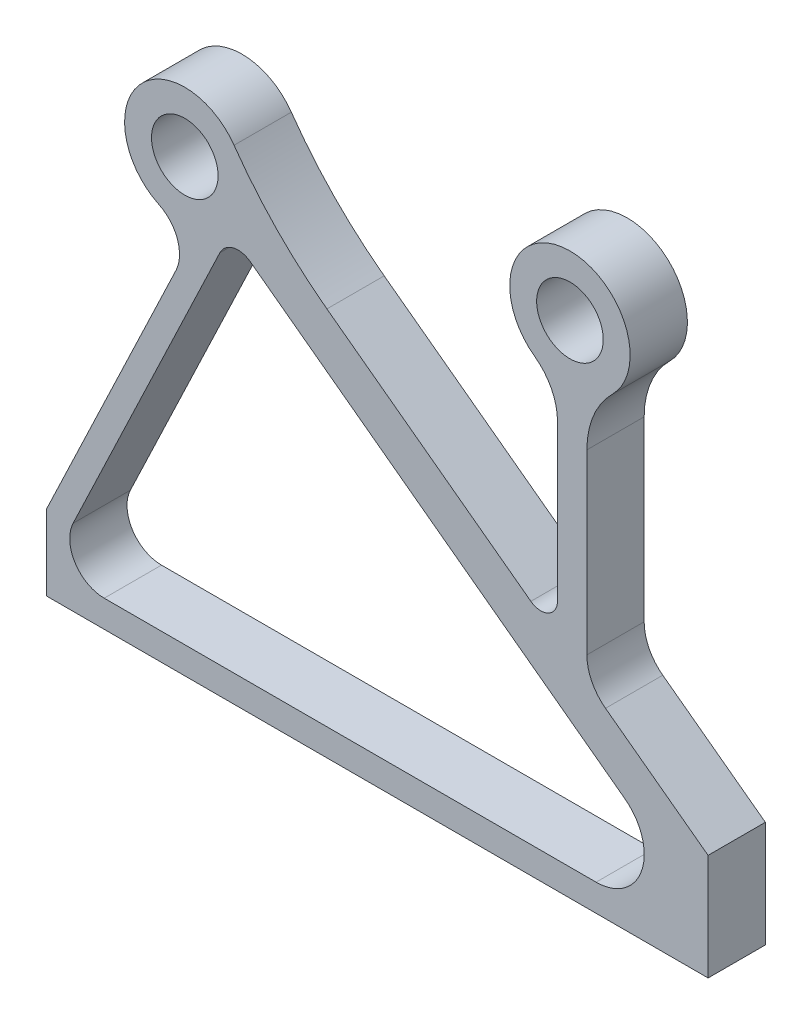
ISO-10303-21;
HEADER;
FILE_DESCRIPTION(('STEP AP214'),'2;1');
FILE_NAME('part.step','',(''),(''),'','','');
FILE_SCHEMA(('AUTOMOTIVE_DESIGN { 1 0 10303 214 1 1 1 1 }'));
ENDSEC;
DATA;
#1=APPLICATION_CONTEXT('core data for automotive mechanical design processes');
#2=APPLICATION_PROTOCOL_DEFINITION('international standard','automotive_design',2000,#1);
#3=PRODUCT_CONTEXT('',#1,'mechanical');
#4=PRODUCT('Part','Part','',(#3));
#5=PRODUCT_RELATED_PRODUCT_CATEGORY('part','',(#4));
#6=PRODUCT_DEFINITION_FORMATION('','',#4);
#7=PRODUCT_DEFINITION_CONTEXT('part definition',#1,'design');
#8=PRODUCT_DEFINITION('design','',#6,#7);
#9=PRODUCT_DEFINITION_SHAPE('','',#8);
#10=(LENGTH_UNIT() NAMED_UNIT(*) SI_UNIT(.MILLI.,.METRE.));
#11=(NAMED_UNIT(*) PLANE_ANGLE_UNIT() SI_UNIT($,.RADIAN.));
#12=(NAMED_UNIT(*) SI_UNIT($,.STERADIAN.) SOLID_ANGLE_UNIT());
#13=UNCERTAINTY_MEASURE_WITH_UNIT(LENGTH_MEASURE(1.E-05),#10,'distance_accuracy_value','');
#14=(GEOMETRIC_REPRESENTATION_CONTEXT(3) GLOBAL_UNCERTAINTY_ASSIGNED_CONTEXT((#13)) GLOBAL_UNIT_ASSIGNED_CONTEXT((#10,
#11,#12)) REPRESENTATION_CONTEXT('',''));
#15=CARTESIAN_POINT('',(0.,0.,0.));
#16=DIRECTION('',(0.,0.,1.));
#17=DIRECTION('',(1.,0.,0.));
#18=AXIS2_PLACEMENT_3D('',#15,#16,#17);
#19=CARTESIAN_POINT('',(368.937215512841,505.129816464179,40.));
#20=DIRECTION('',(0.,0.,1.));
#21=DIRECTION('',(1.,0.,0.));
#22=AXIS2_PLACEMENT_3D('',#19,#20,#21);
#23=PLANE('',#22);
#24=CARTESIAN_POINT('',(96.5,314.,40.));
#25=DIRECTION('',(0.,0.,1.));
#26=DIRECTION('',(1.,0.,0.));
#27=AXIS2_PLACEMENT_3D('',#24,#25,#26);
#28=CIRCLE('',#27,23.25);
#29=CARTESIAN_POINT('',(119.75,314.,40.));
#30=VERTEX_POINT('',#29);
#31=EDGE_CURVE('E251',#30,#30,#28,.T.);
#32=ORIENTED_EDGE('',*,*,#31,.F.);
#33=EDGE_LOOP('',(#32));
#34=FACE_BOUND('',#33,.T.);
#35=CARTESIAN_POINT('',(368.937215512841,505.129816464179,40.));
#36=DIRECTION('',(0.,0.,-1.));
#37=DIRECTION('',(1.,0.,0.));
#38=AXIS2_PLACEMENT_3D('',#35,#36,#37);
#39=CIRCLE('',#38,290.758684927088);
#40=CARTESIAN_POINT('',(195.757922755043,271.571375339825,40.));
#41=VERTEX_POINT('',#40);
#42=CARTESIAN_POINT('',(130.912486716467,338.142268000402,40.));
#43=VERTEX_POINT('',#42);
#44=EDGE_CURVE('E257',#41,#43,#39,.T.);
#45=ORIENTED_EDGE('',*,*,#44,.T.);
#46=CARTESIAN_POINT('',(96.5,314.,40.));
#47=DIRECTION('',(0.,0.,1.));
#48=DIRECTION('',(1.,0.,0.));
#49=AXIS2_PLACEMENT_3D('',#46,#47,#48);
#50=CIRCLE('',#49,42.0365120605205);
#51=CARTESIAN_POINT('',(78.3504812894364,276.083469082876,40.));
#52=VERTEX_POINT('',#51);
#53=EDGE_CURVE('E260',#43,#52,#50,.T.);
#54=ORIENTED_EDGE('',*,*,#53,.T.);
#55=CARTESIAN_POINT('',(67.3543979935997,253.111326465607,40.));
#56=DIRECTION('',(0.,0.,-1.));
#57=DIRECTION('',(1.,0.,0.));
#58=AXIS2_PLACEMENT_3D('',#55,#56,#57);
#59=CIRCLE('',#58,25.4682779998397);
#60=CARTESIAN_POINT('',(90.3406413482298,242.144749938776,40.));
#61=VERTEX_POINT('',#60);
#62=EDGE_CURVE('E263',#52,#61,#59,.T.);
#63=ORIENTED_EDGE('',*,*,#62,.T.);
#64=DIRECTION('',(-0.430597487859219,-0.902544072857016,0.));
#65=VECTOR('',#64,1.);
#66=CARTESIAN_POINT('',(90.3406413482298,242.144749938776,40.));
#67=LINE('',#66,#65);
#68=CARTESIAN_POINT('',(0.,52.7883029415657,40.));
#69=VERTEX_POINT('',#68);
#70=EDGE_CURVE('E265',#61,#69,#67,.T.);
#71=ORIENTED_EDGE('',*,*,#70,.T.);
#72=DIRECTION('',(0.,-1.,0.));
#73=VECTOR('',#72,1.);
#74=CARTESIAN_POINT('',(0.,52.7883029415657,40.));
#75=LINE('',#74,#73);
#76=CARTESIAN_POINT('',(0.,0.,40.));
#77=VERTEX_POINT('',#76);
#78=EDGE_CURVE('E267',#69,#77,#75,.T.);
#79=ORIENTED_EDGE('',*,*,#78,.T.);
#80=DIRECTION('',(1.,0.,0.));
#81=VECTOR('',#80,1.);
#82=CARTESIAN_POINT('',(462.,0.,40.));
#83=LINE('',#82,#81);
#84=CARTESIAN_POINT('',(462.,0.,40.));
#85=VERTEX_POINT('',#84);
#86=EDGE_CURVE('E269',#77,#85,#83,.T.);
#87=ORIENTED_EDGE('',*,*,#86,.T.);
#88=DIRECTION('',(-0.000294675893566808,0.999999956583058,0.));
#89=VECTOR('',#88,1.);
#90=CARTESIAN_POINT('',(461.978142717074,74.1739736920614,40.));
#91=LINE('',#90,#89);
#92=CARTESIAN_POINT('',(461.978142717074,74.1739736920614,40.));
#93=VERTEX_POINT('',#92);
#94=EDGE_CURVE('E271',#85,#93,#91,.T.);
#95=ORIENTED_EDGE('',*,*,#94,.T.);
#96=DIRECTION('',(-0.803272449739284,0.595611762383727,0.));
#97=VECTOR('',#96,1.);
#98=CARTESIAN_POINT('',(390.329817514419,127.299890384021,40.));
#99=LINE('',#98,#97);
#100=CARTESIAN_POINT('',(390.329817514419,127.299890384021,40.));
#101=VERTEX_POINT('',#100);
#102=EDGE_CURVE('E273',#93,#101,#99,.T.);
#103=ORIENTED_EDGE('',*,*,#102,.T.);
#104=CARTESIAN_POINT('',(409.472214887562,153.116305376008,40.));
#105=DIRECTION('',(0.,0.,-1.));
#106=DIRECTION('',(1.,0.,0.));
#107=AXIS2_PLACEMENT_3D('',#104,#105,#106);
#108=CIRCLE('',#107,32.1390519497667);
#109=CARTESIAN_POINT('',(377.333162937795,153.116305376008,40.));
#110=VERTEX_POINT('',#109);
#111=EDGE_CURVE('E275',#101,#110,#108,.T.);
#112=ORIENTED_EDGE('',*,*,#111,.T.);
#113=DIRECTION('',(0.,1.,0.));
#114=VECTOR('',#113,1.);
#115=CARTESIAN_POINT('',(377.333162937795,277.104406008865,40.));
#116=LINE('',#115,#114);
#117=CARTESIAN_POINT('',(377.333162937795,277.104406008865,40.));
#118=VERTEX_POINT('',#117);
#119=EDGE_CURVE('E277',#110,#118,#116,.T.);
#120=ORIENTED_EDGE('',*,*,#119,.T.);
#121=CARTESIAN_POINT('',(437.162247016224,277.104406008865,40.));
#122=DIRECTION('',(0.,0.,-1.));
#123=DIRECTION('',(-1.,0.,0.));
#124=AXIS2_PLACEMENT_3D('',#121,#122,#123);
#125=CIRCLE('',#124,59.8290840784292);
#126=CARTESIAN_POINT('',(395.072603755957,319.624768564789,40.));
#127=VERTEX_POINT('',#126);
#128=EDGE_CURVE('E281',#118,#127,#125,.T.);
#129=ORIENTED_EDGE('',*,*,#128,.T.);
#130=CARTESIAN_POINT('',(365.5,349.5,40.));
#131=DIRECTION('',(0.,0.,1.));
#132=DIRECTION('',(1.,0.,0.));
#133=AXIS2_PLACEMENT_3D('',#130,#131,#132);
#134=CIRCLE('',#133,42.0365120605205);
#135=CARTESIAN_POINT('',(340.80365373767,315.482962687715,40.));
#136=VERTEX_POINT('',#135);
#137=EDGE_CURVE('E283',#127,#136,#134,.T.);
#138=ORIENTED_EDGE('',*,*,#137,.T.);
#139=CARTESIAN_POINT('',(318.008834731175,284.085111344278,40.));
#140=DIRECTION('',(0.,0.,-1.));
#141=DIRECTION('',(-1.,0.,0.));
#142=AXIS2_PLACEMENT_3D('',#139,#140,#141);
#143=CIRCLE('',#142,38.7998562178193);
#144=CARTESIAN_POINT('',(356.808690948994,284.085111344278,40.));
#145=VERTEX_POINT('',#144);
#146=EDGE_CURVE('E285',#136,#145,#143,.T.);
#147=ORIENTED_EDGE('',*,*,#146,.T.);
#148=DIRECTION('',(0.,-1.,0.));
#149=VECTOR('',#148,1.);
#150=CARTESIAN_POINT('',(356.808690948994,284.085111344278,40.));
#151=LINE('',#150,#149);
#152=CARTESIAN_POINT('',(356.808690948994,175.310171823096,40.));
#153=VERTEX_POINT('',#152);
#154=EDGE_CURVE('E287',#145,#153,#151,.T.);
#155=ORIENTED_EDGE('',*,*,#154,.T.);
#156=CARTESIAN_POINT('',(345.151870943023,175.310171823096,40.));
#157=DIRECTION('',(0.,0.,-1.));
#158=DIRECTION('',(-1.,0.,0.));
#159=AXIS2_PLACEMENT_3D('',#156,#157,#158);
#160=CIRCLE('',#159,11.6568200059709);
#161=CARTESIAN_POINT('',(338.208931835477,165.94656946073,40.));
#162=VERTEX_POINT('',#161);
#163=EDGE_CURVE('E289',#153,#162,#160,.T.);
#164=ORIENTED_EDGE('',*,*,#163,.T.);
#165=DIRECTION('',(-0.803272449739284,0.595611762383727,0.));
#166=VECTOR('',#165,1.);
#167=CARTESIAN_POINT('',(338.208931835477,165.94656946073,40.));
#168=LINE('',#167,#166);
#169=EDGE_CURVE('E291',#162,#41,#168,.T.);
#170=ORIENTED_EDGE('',*,*,#169,.T.);
#171=EDGE_LOOP('',(#45,#54,#63,#71,#79,#87,#95,#103,#112,#120,#129,#138,#147,#155,#164,#170));
#172=FACE_BOUND('',#171,.T.);
#173=CARTESIAN_POINT('',(365.5,349.5,40.));
#174=DIRECTION('',(0.,0.,1.));
#175=DIRECTION('',(1.,0.,0.));
#176=AXIS2_PLACEMENT_3D('',#173,#174,#175);
#177=CIRCLE('',#176,23.25);
#178=CARTESIAN_POINT('',(388.75,349.5,40.));
#179=VERTEX_POINT('',#178);
#180=EDGE_CURVE('E245',#179,#179,#177,.T.);
#181=ORIENTED_EDGE('',*,*,#180,.F.);
#182=EDGE_LOOP('',(#181));
#183=FACE_BOUND('',#182,.T.);
#184=DIRECTION('',(-0.430597487859219,-0.902544072857016,0.));
#185=VECTOR('',#184,1.);
#186=CARTESIAN_POINT('',(18.4911150139431,53.2864328711373,40.));
#187=LINE('',#186,#185);
#188=CARTESIAN_POINT('',(120.985954342348,268.118410164344,40.));
#189=VERTEX_POINT('',#188);
#190=CARTESIAN_POINT('',(18.4911150139431,53.2864328711373,40.));
#191=VERTEX_POINT('',#190);
#192=EDGE_CURVE('E201',#189,#191,#187,.T.);
#193=ORIENTED_EDGE('',*,*,#192,.F.);
#194=CARTESIAN_POINT('',(133.772298014734,262.018134698786,40.));
#195=DIRECTION('',(0.,0.,1.));
#196=DIRECTION('',(-1.,0.,0.));
#197=AXIS2_PLACEMENT_3D('',#194,#195,#196);
#198=CIRCLE('',#197,14.1670019857439);
#199=CARTESIAN_POINT('',(142.210331035157,273.398097089336,40.));
#200=VERTEX_POINT('',#199);
#201=EDGE_CURVE('E193',#200,#189,#198,.T.);
#202=ORIENTED_EDGE('',*,*,#201,.F.);
#203=DIRECTION('',(-0.803272449739284,0.595611762383727,0.));
#204=VECTOR('',#203,1.);
#205=CARTESIAN_POINT('',(142.210331035157,273.398097089336,40.));
#206=LINE('',#205,#204);
#207=CARTESIAN_POINT('',(403.788200612837,79.4429129543513,40.));
#208=VERTEX_POINT('',#207);
#209=EDGE_CURVE('E223',#208,#200,#206,.T.);
#210=ORIENTED_EDGE('',*,*,#209,.F.);
#211=CARTESIAN_POINT('',(383.771110309799,52.4468423931808,40.));
#212=DIRECTION('',(0.,0.,1.));
#213=DIRECTION('',(-1.,0.,0.));
#214=AXIS2_PLACEMENT_3D('',#211,#212,#213);
#215=CIRCLE('',#214,33.6076141661931);
#216=CARTESIAN_POINT('',(383.771110309799,18.8392282269877,40.));
#217=VERTEX_POINT('',#216);
#218=EDGE_CURVE('E221',#217,#208,#215,.T.);
#219=ORIENTED_EDGE('',*,*,#218,.F.);
#220=DIRECTION('',(1.,0.,0.));
#221=VECTOR('',#220,1.);
#222=CARTESIAN_POINT('',(383.771110309799,18.8392282269877,40.));
#223=LINE('',#222,#221);
#224=CARTESIAN_POINT('',(40.2233776817561,18.8392282269876,40.));
#225=VERTEX_POINT('',#224);
#226=EDGE_CURVE('E216',#225,#217,#223,.T.);
#227=ORIENTED_EDGE('',*,*,#226,.F.);
#228=CARTESIAN_POINT('',(40.2233776817561,42.9181217917298,40.));
#229=DIRECTION('',(0.,0.,1.));
#230=DIRECTION('',(1.,0.,0.));
#231=AXIS2_PLACEMENT_3D('',#228,#229,#230);
#232=CIRCLE('',#231,24.0788935647422);
#233=EDGE_CURVE('E214',#191,#225,#232,.T.);
#234=ORIENTED_EDGE('',*,*,#233,.F.);
#235=EDGE_LOOP('',(#193,#202,#210,#219,#227,#234));
#236=FACE_BOUND('',#235,.T.);
#237=ADVANCED_FACE('F44',(#34,#172,#183,#236),#23,.T.);
#238=CARTESIAN_POINT('',(368.937215512841,505.129816464179,0.));
#239=DIRECTION('',(0.,0.,1.));
#240=DIRECTION('',(1.,0.,0.));
#241=AXIS2_PLACEMENT_3D('',#238,#239,#240);
#242=PLANE('',#241);
#243=CARTESIAN_POINT('',(365.5,349.5,0.));
#244=DIRECTION('',(0.,0.,1.));
#245=DIRECTION('',(1.,0.,0.));
#246=AXIS2_PLACEMENT_3D('',#243,#244,#245);
#247=CIRCLE('',#246,23.25);
#248=CARTESIAN_POINT('',(388.75,349.5,0.));
#249=VERTEX_POINT('',#248);
#250=EDGE_CURVE('E209',#249,#249,#247,.T.);
#251=ORIENTED_EDGE('',*,*,#250,.T.);
#252=EDGE_LOOP('',(#251));
#253=FACE_BOUND('',#252,.T.);
#254=CARTESIAN_POINT('',(96.5,314.,0.));
#255=DIRECTION('',(0.,0.,1.));
#256=DIRECTION('',(1.,0.,0.));
#257=AXIS2_PLACEMENT_3D('',#254,#255,#256);
#258=CIRCLE('',#257,23.25);
#259=CARTESIAN_POINT('',(119.75,314.,0.));
#260=VERTEX_POINT('',#259);
#261=EDGE_CURVE('E248',#260,#260,#258,.T.);
#262=ORIENTED_EDGE('',*,*,#261,.T.);
#263=EDGE_LOOP('',(#262));
#264=FACE_BOUND('',#263,.T.);
#265=CARTESIAN_POINT('',(368.937215512841,505.129816464179,0.));
#266=DIRECTION('',(0.,0.,-1.));
#267=DIRECTION('',(1.,0.,0.));
#268=AXIS2_PLACEMENT_3D('',#265,#266,#267);
#269=CIRCLE('',#268,290.758684927088);
#270=CARTESIAN_POINT('',(195.757922755043,271.571375339825,0.));
#271=VERTEX_POINT('',#270);
#272=CARTESIAN_POINT('',(130.912486716467,338.142268000402,0.));
#273=VERTEX_POINT('',#272);
#274=EDGE_CURVE('E254',#271,#273,#269,.T.);
#275=ORIENTED_EDGE('',*,*,#274,.F.);
#276=DIRECTION('',(-0.803272449739284,0.595611762383727,0.));
#277=VECTOR('',#276,1.);
#278=CARTESIAN_POINT('',(338.208931835477,165.94656946073,0.));
#279=LINE('',#278,#277);
#280=CARTESIAN_POINT('',(338.208931835477,165.94656946073,0.));
#281=VERTEX_POINT('',#280);
#282=EDGE_CURVE('E261',#281,#271,#279,.T.);
#283=ORIENTED_EDGE('',*,*,#282,.F.);
#284=CARTESIAN_POINT('',(345.151870943023,175.310171823096,0.));
#285=DIRECTION('',(0.,0.,-1.));
#286=DIRECTION('',(-1.,0.,0.));
#287=AXIS2_PLACEMENT_3D('',#284,#285,#286);
#288=CIRCLE('',#287,11.6568200059709);
#289=CARTESIAN_POINT('',(356.808690948994,175.310171823096,0.));
#290=VERTEX_POINT('',#289);
#291=EDGE_CURVE('E322',#290,#281,#288,.T.);
#292=ORIENTED_EDGE('',*,*,#291,.F.);
#293=DIRECTION('',(0.,-1.,0.));
#294=VECTOR('',#293,1.);
#295=CARTESIAN_POINT('',(356.808690948994,284.085111344278,0.));
#296=LINE('',#295,#294);
#297=CARTESIAN_POINT('',(356.808690948994,284.085111344278,0.));
#298=VERTEX_POINT('',#297);
#299=EDGE_CURVE('E320',#298,#290,#296,.T.);
#300=ORIENTED_EDGE('',*,*,#299,.F.);
#301=CARTESIAN_POINT('',(318.008834731175,284.085111344278,0.));
#302=DIRECTION('',(0.,0.,-1.));
#303=DIRECTION('',(-1.,0.,0.));
#304=AXIS2_PLACEMENT_3D('',#301,#302,#303);
#305=CIRCLE('',#304,38.7998562178193);
#306=CARTESIAN_POINT('',(340.80365373767,315.482962687715,0.));
#307=VERTEX_POINT('',#306);
#308=EDGE_CURVE('E318',#307,#298,#305,.T.);
#309=ORIENTED_EDGE('',*,*,#308,.F.);
#310=CARTESIAN_POINT('',(365.5,349.5,0.));
#311=DIRECTION('',(0.,0.,1.));
#312=DIRECTION('',(1.,0.,0.));
#313=AXIS2_PLACEMENT_3D('',#310,#311,#312);
#314=CIRCLE('',#313,42.0365120605205);
#315=CARTESIAN_POINT('',(395.072603755957,319.624768564789,0.));
#316=VERTEX_POINT('',#315);
#317=EDGE_CURVE('E316',#316,#307,#314,.T.);
#318=ORIENTED_EDGE('',*,*,#317,.F.);
#319=CARTESIAN_POINT('',(437.162247016224,277.104406008865,0.));
#320=DIRECTION('',(0.,0.,-1.));
#321=DIRECTION('',(-1.,0.,0.));
#322=AXIS2_PLACEMENT_3D('',#319,#320,#321);
#323=CIRCLE('',#322,59.8290840784292);
#324=CARTESIAN_POINT('',(377.333162937795,277.104406008865,0.));
#325=VERTEX_POINT('',#324);
#326=EDGE_CURVE('E314',#325,#316,#323,.T.);
#327=ORIENTED_EDGE('',*,*,#326,.F.);
#328=DIRECTION('',(0.,1.,0.));
#329=VECTOR('',#328,1.);
#330=CARTESIAN_POINT('',(377.333162937795,277.104406008865,0.));
#331=LINE('',#330,#329);
#332=CARTESIAN_POINT('',(377.333162937795,153.116305376008,0.));
#333=VERTEX_POINT('',#332);
#334=EDGE_CURVE('E312',#333,#325,#331,.T.);
#335=ORIENTED_EDGE('',*,*,#334,.F.);
#336=CARTESIAN_POINT('',(409.472214887562,153.116305376008,0.));
#337=DIRECTION('',(0.,0.,-1.));
#338=DIRECTION('',(1.,0.,0.));
#339=AXIS2_PLACEMENT_3D('',#336,#337,#338);
#340=CIRCLE('',#339,32.1390519497667);
#341=CARTESIAN_POINT('',(390.329817514419,127.299890384021,0.));
#342=VERTEX_POINT('',#341);
#343=EDGE_CURVE('E310',#342,#333,#340,.T.);
#344=ORIENTED_EDGE('',*,*,#343,.F.);
#345=DIRECTION('',(-0.803272449739284,0.595611762383727,0.));
#346=VECTOR('',#345,1.);
#347=CARTESIAN_POINT('',(390.329817514419,127.299890384021,0.));
#348=LINE('',#347,#346);
#349=CARTESIAN_POINT('',(461.978142717074,74.1739736920614,0.));
#350=VERTEX_POINT('',#349);
#351=EDGE_CURVE('E308',#350,#342,#348,.T.);
#352=ORIENTED_EDGE('',*,*,#351,.F.);
#353=DIRECTION('',(-0.000294675893566808,0.999999956583058,0.));
#354=VECTOR('',#353,1.);
#355=CARTESIAN_POINT('',(461.978142717074,74.1739736920614,0.));
#356=LINE('',#355,#354);
#357=CARTESIAN_POINT('',(462.,0.,0.));
#358=VERTEX_POINT('',#357);
#359=EDGE_CURVE('E306',#358,#350,#356,.T.);
#360=ORIENTED_EDGE('',*,*,#359,.F.);
#361=DIRECTION('',(1.,0.,0.));
#362=VECTOR('',#361,1.);
#363=CARTESIAN_POINT('',(462.,0.,0.));
#364=LINE('',#363,#362);
#365=CARTESIAN_POINT('',(0.,0.,0.));
#366=VERTEX_POINT('',#365);
#367=EDGE_CURVE('E304',#366,#358,#364,.T.);
#368=ORIENTED_EDGE('',*,*,#367,.F.);
#369=DIRECTION('',(0.,-1.,0.));
#370=VECTOR('',#369,1.);
#371=CARTESIAN_POINT('',(0.,52.7883029415657,0.));
#372=LINE('',#371,#370);
#373=CARTESIAN_POINT('',(0.,52.7883029415657,0.));
#374=VERTEX_POINT('',#373);
#375=EDGE_CURVE('E302',#374,#366,#372,.T.);
#376=ORIENTED_EDGE('',*,*,#375,.F.);
#377=DIRECTION('',(-0.430597487859219,-0.902544072857016,0.));
#378=VECTOR('',#377,1.);
#379=CARTESIAN_POINT('',(90.3406413482298,242.144749938776,0.));
#380=LINE('',#379,#378);
#381=CARTESIAN_POINT('',(90.3406413482298,242.144749938776,0.));
#382=VERTEX_POINT('',#381);
#383=EDGE_CURVE('E300',#382,#374,#380,.T.);
#384=ORIENTED_EDGE('',*,*,#383,.F.);
#385=CARTESIAN_POINT('',(67.3543979935997,253.111326465607,0.));
#386=DIRECTION('',(0.,0.,-1.));
#387=DIRECTION('',(1.,0.,0.));
#388=AXIS2_PLACEMENT_3D('',#385,#386,#387);
#389=CIRCLE('',#388,25.4682779998397);
#390=CARTESIAN_POINT('',(78.3504812894364,276.083469082876,0.));
#391=VERTEX_POINT('',#390);
#392=EDGE_CURVE('E298',#391,#382,#389,.T.);
#393=ORIENTED_EDGE('',*,*,#392,.F.);
#394=CARTESIAN_POINT('',(96.5,314.,0.));
#395=DIRECTION('',(0.,0.,1.));
#396=DIRECTION('',(1.,0.,0.));
#397=AXIS2_PLACEMENT_3D('',#394,#395,#396);
#398=CIRCLE('',#397,42.0365120605205);
#399=EDGE_CURVE('E296',#273,#391,#398,.T.);
#400=ORIENTED_EDGE('',*,*,#399,.F.);
#401=EDGE_LOOP('',(#275,#283,#292,#300,#309,#318,#327,#335,#344,#352,#360,#368,#376,#384,#393,#400));
#402=FACE_BOUND('',#401,.T.);
#403=CARTESIAN_POINT('',(133.772298014734,262.018134698786,0.));
#404=DIRECTION('',(0.,0.,1.));
#405=DIRECTION('',(-1.,0.,0.));
#406=AXIS2_PLACEMENT_3D('',#403,#404,#405);
#407=CIRCLE('',#406,14.1670019857439);
#408=CARTESIAN_POINT('',(142.210331035157,273.398097089336,0.));
#409=VERTEX_POINT('',#408);
#410=CARTESIAN_POINT('',(120.985954342348,268.118410164344,0.));
#411=VERTEX_POINT('',#410);
#412=EDGE_CURVE('E67',#409,#411,#407,.T.);
#413=ORIENTED_EDGE('',*,*,#412,.T.);
#414=DIRECTION('',(-0.430597487859219,-0.902544072857016,0.));
#415=VECTOR('',#414,1.);
#416=CARTESIAN_POINT('',(18.4911150139431,53.2864328711373,0.));
#417=LINE('',#416,#415);
#418=CARTESIAN_POINT('',(18.4911150139431,53.2864328711373,0.));
#419=VERTEX_POINT('',#418);
#420=EDGE_CURVE('E208',#411,#419,#417,.T.);
#421=ORIENTED_EDGE('',*,*,#420,.T.);
#422=CARTESIAN_POINT('',(40.2233776817561,42.9181217917298,0.));
#423=DIRECTION('',(0.,0.,1.));
#424=DIRECTION('',(1.,0.,0.));
#425=AXIS2_PLACEMENT_3D('',#422,#423,#424);
#426=CIRCLE('',#425,24.0788935647422);
#427=CARTESIAN_POINT('',(40.2233776817561,18.8392282269876,0.));
#428=VERTEX_POINT('',#427);
#429=EDGE_CURVE('E227',#419,#428,#426,.T.);
#430=ORIENTED_EDGE('',*,*,#429,.T.);
#431=DIRECTION('',(1.,0.,0.));
#432=VECTOR('',#431,1.);
#433=CARTESIAN_POINT('',(383.771110309799,18.8392282269877,0.));
#434=LINE('',#433,#432);
#435=CARTESIAN_POINT('',(383.771110309799,18.8392282269877,0.));
#436=VERTEX_POINT('',#435);
#437=EDGE_CURVE('E230',#428,#436,#434,.T.);
#438=ORIENTED_EDGE('',*,*,#437,.T.);
#439=CARTESIAN_POINT('',(383.771110309799,52.4468423931808,0.));
#440=DIRECTION('',(0.,0.,1.));
#441=DIRECTION('',(-1.,0.,0.));
#442=AXIS2_PLACEMENT_3D('',#439,#440,#441);
#443=CIRCLE('',#442,33.6076141661931);
#444=CARTESIAN_POINT('',(403.788200612837,79.4429129543514,0.));
#445=VERTEX_POINT('',#444);
#446=EDGE_CURVE('E233',#436,#445,#443,.T.);
#447=ORIENTED_EDGE('',*,*,#446,.T.);
#448=DIRECTION('',(-0.803272449739284,0.595611762383727,0.));
#449=VECTOR('',#448,1.);
#450=CARTESIAN_POINT('',(142.210331035157,273.398097089336,0.));
#451=LINE('',#450,#449);
#452=EDGE_CURVE('E202',#445,#409,#451,.T.);
#453=ORIENTED_EDGE('',*,*,#452,.T.);
#454=EDGE_LOOP('',(#413,#421,#430,#438,#447,#453));
#455=FACE_BOUND('',#454,.T.);
#456=ADVANCED_FACE('F376',(#253,#264,#402,#455),#242,.F.);
#457=CARTESIAN_POINT('',(368.937215512841,505.129816464179,40.));
#458=DIRECTION('',(0.,0.,-1.));
#459=DIRECTION('',(-1.,0.,0.));
#460=AXIS2_PLACEMENT_3D('',#457,#458,#459);
#461=CYLINDRICAL_SURFACE('',#460,290.758684927088);
#462=ORIENTED_EDGE('',*,*,#274,.T.);
#463=DIRECTION('',(0.,0.,-1.));
#464=VECTOR('',#463,1.);
#465=CARTESIAN_POINT('',(130.912486716467,338.142268000402,40.));
#466=LINE('',#465,#464);
#467=EDGE_CURVE('E12',#43,#273,#466,.T.);
#468=ORIENTED_EDGE('',*,*,#467,.F.);
#469=ORIENTED_EDGE('',*,*,#44,.F.);
#470=DIRECTION('',(0.,0.,-1.));
#471=VECTOR('',#470,1.);
#472=CARTESIAN_POINT('',(195.757922755043,271.571375339825,40.));
#473=LINE('',#472,#471);
#474=EDGE_CURVE('E293',#41,#271,#473,.T.);
#475=ORIENTED_EDGE('',*,*,#474,.T.);
#476=EDGE_LOOP('',(#462,#468,#469,#475));
#477=FACE_BOUND('',#476,.T.);
#478=ADVANCED_FACE('F46',(#477),#461,.F.);
#479=CARTESIAN_POINT('',(96.5,314.,40.));
#480=DIRECTION('',(0.,0.,-1.));
#481=DIRECTION('',(-1.,0.,0.));
#482=AXIS2_PLACEMENT_3D('',#479,#480,#481);
#483=CYLINDRICAL_SURFACE('',#482,42.0365120605205);
#484=ORIENTED_EDGE('',*,*,#399,.T.);
#485=DIRECTION('',(0.,0.,-1.));
#486=VECTOR('',#485,1.);
#487=CARTESIAN_POINT('',(78.3504812894364,276.083469082876,40.));
#488=LINE('',#487,#486);
#489=EDGE_CURVE('E52',#52,#391,#488,.T.);
#490=ORIENTED_EDGE('',*,*,#489,.F.);
#491=ORIENTED_EDGE('',*,*,#53,.F.);
#492=ORIENTED_EDGE('',*,*,#467,.T.);
#493=EDGE_LOOP('',(#484,#490,#491,#492));
#494=FACE_BOUND('',#493,.T.);
#495=ADVANCED_FACE('F394',(#494),#483,.T.);
#496=CARTESIAN_POINT('',(67.3543979935997,253.111326465607,40.));
#497=DIRECTION('',(0.,0.,-1.));
#498=DIRECTION('',(-1.,0.,0.));
#499=AXIS2_PLACEMENT_3D('',#496,#497,#498);
#500=CYLINDRICAL_SURFACE('',#499,25.4682779998397);
#501=ORIENTED_EDGE('',*,*,#392,.T.);
#502=DIRECTION('',(0.,0.,-1.));
#503=VECTOR('',#502,1.);
#504=CARTESIAN_POINT('',(90.3406413482298,242.144749938776,40.));
#505=LINE('',#504,#503);
#506=EDGE_CURVE('E363',#61,#382,#505,.T.);
#507=ORIENTED_EDGE('',*,*,#506,.F.);
#508=ORIENTED_EDGE('',*,*,#62,.F.);
#509=ORIENTED_EDGE('',*,*,#489,.T.);
#510=EDGE_LOOP('',(#501,#507,#508,#509));
#511=FACE_BOUND('',#510,.T.);
#512=ADVANCED_FACE('F370',(#511),#500,.F.);
#513=CARTESIAN_POINT('',(90.3406413482298,242.144749938776,40.));
#514=DIRECTION('',(0.902544072857016,-0.430597487859219,0.));
#515=DIRECTION('',(0.430597487859219,0.902544072857016,0.));
#516=AXIS2_PLACEMENT_3D('',#513,#514,#515);
#517=PLANE('',#516);
#518=ORIENTED_EDGE('',*,*,#383,.T.);
#519=DIRECTION('',(0.,0.,-1.));
#520=VECTOR('',#519,1.);
#521=CARTESIAN_POINT('',(0.,52.7883029415657,40.));
#522=LINE('',#521,#520);
#523=EDGE_CURVE('E360',#69,#374,#522,.T.);
#524=ORIENTED_EDGE('',*,*,#523,.F.);
#525=ORIENTED_EDGE('',*,*,#70,.F.);
#526=ORIENTED_EDGE('',*,*,#506,.T.);
#527=EDGE_LOOP('',(#518,#524,#525,#526));
#528=FACE_BOUND('',#527,.T.);
#529=ADVANCED_FACE('F382',(#528),#517,.F.);
#530=CARTESIAN_POINT('',(0.,52.7883029415657,40.));
#531=DIRECTION('',(1.,0.,0.));
#532=DIRECTION('',(0.,0.,-1.));
#533=AXIS2_PLACEMENT_3D('',#530,#531,#532);
#534=PLANE('',#533);
#535=ORIENTED_EDGE('',*,*,#375,.T.);
#536=DIRECTION('',(0.,0.,-1.));
#537=VECTOR('',#536,1.);
#538=CARTESIAN_POINT('',(0.,0.,40.));
#539=LINE('',#538,#537);
#540=EDGE_CURVE('E357',#77,#366,#539,.T.);
#541=ORIENTED_EDGE('',*,*,#540,.F.);
#542=ORIENTED_EDGE('',*,*,#78,.F.);
#543=ORIENTED_EDGE('',*,*,#523,.T.);
#544=EDGE_LOOP('',(#535,#541,#542,#543));
#545=FACE_BOUND('',#544,.T.);
#546=ADVANCED_FACE('F386',(#545),#534,.F.);
#547=CARTESIAN_POINT('',(462.,0.,40.));
#548=DIRECTION('',(0.,1.,0.));
#549=DIRECTION('',(0.,0.,1.));
#550=AXIS2_PLACEMENT_3D('',#547,#548,#549);
#551=PLANE('',#550);
#552=ORIENTED_EDGE('',*,*,#367,.T.);
#553=DIRECTION('',(0.,0.,-1.));
#554=VECTOR('',#553,1.);
#555=CARTESIAN_POINT('',(462.,0.,40.));
#556=LINE('',#555,#554);
#557=EDGE_CURVE('E354',#85,#358,#556,.T.);
#558=ORIENTED_EDGE('',*,*,#557,.F.);
#559=ORIENTED_EDGE('',*,*,#86,.F.);
#560=ORIENTED_EDGE('',*,*,#540,.T.);
#561=EDGE_LOOP('',(#552,#558,#559,#560));
#562=FACE_BOUND('',#561,.T.);
#563=ADVANCED_FACE('F447',(#562),#551,.F.);
#564=CARTESIAN_POINT('',(461.978142717074,74.1739736920614,40.));
#565=DIRECTION('',(-0.999999956583058,-0.000294675893566808,0.));
#566=DIRECTION('',(0.000294675893566808,-0.999999956583058,0.));
#567=AXIS2_PLACEMENT_3D('',#564,#565,#566);
#568=PLANE('',#567);
#569=ORIENTED_EDGE('',*,*,#359,.T.);
#570=DIRECTION('',(0.,0.,-1.));
#571=VECTOR('',#570,1.);
#572=CARTESIAN_POINT('',(461.978142717074,74.1739736920614,40.));
#573=LINE('',#572,#571);
#574=EDGE_CURVE('E351',#93,#350,#573,.T.);
#575=ORIENTED_EDGE('',*,*,#574,.F.);
#576=ORIENTED_EDGE('',*,*,#94,.F.);
#577=ORIENTED_EDGE('',*,*,#557,.T.);
#578=EDGE_LOOP('',(#569,#575,#576,#577));
#579=FACE_BOUND('',#578,.T.);
#580=ADVANCED_FACE('F444',(#579),#568,.F.);
#581=CARTESIAN_POINT('',(390.329817514419,127.299890384021,40.));
#582=DIRECTION('',(-0.595611762383727,-0.803272449739284,0.));
#583=DIRECTION('',(0.803272449739284,-0.595611762383727,0.));
#584=AXIS2_PLACEMENT_3D('',#581,#582,#583);
#585=PLANE('',#584);
#586=ORIENTED_EDGE('',*,*,#351,.T.);
#587=DIRECTION('',(0.,0.,-1.));
#588=VECTOR('',#587,1.);
#589=CARTESIAN_POINT('',(390.329817514419,127.299890384021,40.));
#590=LINE('',#589,#588);
#591=EDGE_CURVE('E348',#101,#342,#590,.T.);
#592=ORIENTED_EDGE('',*,*,#591,.F.);
#593=ORIENTED_EDGE('',*,*,#102,.F.);
#594=ORIENTED_EDGE('',*,*,#574,.T.);
#595=EDGE_LOOP('',(#586,#592,#593,#594));
#596=FACE_BOUND('',#595,.T.);
#597=ADVANCED_FACE('F440',(#596),#585,.F.);
#598=CARTESIAN_POINT('',(409.472214887562,153.116305376008,40.));
#599=DIRECTION('',(0.,0.,-1.));
#600=DIRECTION('',(-1.,0.,0.));
#601=AXIS2_PLACEMENT_3D('',#598,#599,#600);
#602=CYLINDRICAL_SURFACE('',#601,32.1390519497667);
#603=ORIENTED_EDGE('',*,*,#343,.T.);
#604=DIRECTION('',(0.,0.,-1.));
#605=VECTOR('',#604,1.);
#606=CARTESIAN_POINT('',(377.333162937795,153.116305376008,40.));
#607=LINE('',#606,#605);
#608=EDGE_CURVE('E345',#110,#333,#607,.T.);
#609=ORIENTED_EDGE('',*,*,#608,.F.);
#610=ORIENTED_EDGE('',*,*,#111,.F.);
#611=ORIENTED_EDGE('',*,*,#591,.T.);
#612=EDGE_LOOP('',(#603,#609,#610,#611));
#613=FACE_BOUND('',#612,.T.);
#614=ADVANCED_FACE('F436',(#613),#602,.F.);
#615=CARTESIAN_POINT('',(377.333162937795,277.104406008865,40.));
#616=DIRECTION('',(-1.,0.,0.));
#617=DIRECTION('',(0.,0.,1.));
#618=AXIS2_PLACEMENT_3D('',#615,#616,#617);
#619=PLANE('',#618);
#620=ORIENTED_EDGE('',*,*,#334,.T.);
#621=DIRECTION('',(0.,0.,-1.));
#622=VECTOR('',#621,1.);
#623=CARTESIAN_POINT('',(377.333162937795,277.104406008865,40.));
#624=LINE('',#623,#622);
#625=EDGE_CURVE('E342',#118,#325,#624,.T.);
#626=ORIENTED_EDGE('',*,*,#625,.F.);
#627=ORIENTED_EDGE('',*,*,#119,.F.);
#628=ORIENTED_EDGE('',*,*,#608,.T.);
#629=EDGE_LOOP('',(#620,#626,#627,#628));
#630=FACE_BOUND('',#629,.T.);
#631=ADVANCED_FACE('F431',(#630),#619,.F.);
#632=CARTESIAN_POINT('',(437.162247016224,277.104406008865,40.));
#633=DIRECTION('',(0.,0.,-1.));
#634=DIRECTION('',(-1.,0.,0.));
#635=AXIS2_PLACEMENT_3D('',#632,#633,#634);
#636=CYLINDRICAL_SURFACE('',#635,59.8290840784292);
#637=ORIENTED_EDGE('',*,*,#326,.T.);
#638=DIRECTION('',(0.,0.,-1.));
#639=VECTOR('',#638,1.);
#640=CARTESIAN_POINT('',(395.072603755957,319.624768564789,40.));
#641=LINE('',#640,#639);
#642=EDGE_CURVE('E339',#127,#316,#641,.T.);
#643=ORIENTED_EDGE('',*,*,#642,.F.);
#644=ORIENTED_EDGE('',*,*,#128,.F.);
#645=ORIENTED_EDGE('',*,*,#625,.T.);
#646=EDGE_LOOP('',(#637,#643,#644,#645));
#647=FACE_BOUND('',#646,.T.);
#648=ADVANCED_FACE('F425',(#647),#636,.F.);
#649=CARTESIAN_POINT('',(365.5,349.5,40.));
#650=DIRECTION('',(0.,0.,-1.));
#651=DIRECTION('',(-1.,0.,0.));
#652=AXIS2_PLACEMENT_3D('',#649,#650,#651);
#653=CYLINDRICAL_SURFACE('',#652,42.0365120605205);
#654=ORIENTED_EDGE('',*,*,#317,.T.);
#655=DIRECTION('',(0.,0.,-1.));
#656=VECTOR('',#655,1.);
#657=CARTESIAN_POINT('',(340.80365373767,315.482962687715,40.));
#658=LINE('',#657,#656);
#659=EDGE_CURVE('E336',#136,#307,#658,.T.);
#660=ORIENTED_EDGE('',*,*,#659,.F.);
#661=ORIENTED_EDGE('',*,*,#137,.F.);
#662=ORIENTED_EDGE('',*,*,#642,.T.);
#663=EDGE_LOOP('',(#654,#660,#661,#662));
#664=FACE_BOUND('',#663,.T.);
#665=ADVANCED_FACE('F421',(#664),#653,.T.);
#666=CARTESIAN_POINT('',(318.008834731175,284.085111344278,40.));
#667=DIRECTION('',(0.,0.,-1.));
#668=DIRECTION('',(-1.,0.,0.));
#669=AXIS2_PLACEMENT_3D('',#666,#667,#668);
#670=CYLINDRICAL_SURFACE('',#669,38.7998562178193);
#671=ORIENTED_EDGE('',*,*,#308,.T.);
#672=DIRECTION('',(0.,0.,-1.));
#673=VECTOR('',#672,1.);
#674=CARTESIAN_POINT('',(356.808690948994,284.085111344278,40.));
#675=LINE('',#674,#673);
#676=EDGE_CURVE('E333',#145,#298,#675,.T.);
#677=ORIENTED_EDGE('',*,*,#676,.F.);
#678=ORIENTED_EDGE('',*,*,#146,.F.);
#679=ORIENTED_EDGE('',*,*,#659,.T.);
#680=EDGE_LOOP('',(#671,#677,#678,#679));
#681=FACE_BOUND('',#680,.T.);
#682=ADVANCED_FACE('F416',(#681),#670,.F.);
#683=CARTESIAN_POINT('',(356.808690948994,284.085111344278,40.));
#684=DIRECTION('',(1.,0.,0.));
#685=DIRECTION('',(0.,1.,0.));
#686=AXIS2_PLACEMENT_3D('',#683,#684,#685);
#687=PLANE('',#686);
#688=ORIENTED_EDGE('',*,*,#299,.T.);
#689=DIRECTION('',(0.,0.,-1.));
#690=VECTOR('',#689,1.);
#691=CARTESIAN_POINT('',(356.808690948994,175.310171823096,40.));
#692=LINE('',#691,#690);
#693=EDGE_CURVE('E330',#153,#290,#692,.T.);
#694=ORIENTED_EDGE('',*,*,#693,.F.);
#695=ORIENTED_EDGE('',*,*,#154,.F.);
#696=ORIENTED_EDGE('',*,*,#676,.T.);
#697=EDGE_LOOP('',(#688,#694,#695,#696));
#698=FACE_BOUND('',#697,.T.);
#699=ADVANCED_FACE('F410',(#698),#687,.F.);
#700=CARTESIAN_POINT('',(345.151870943023,175.310171823096,40.));
#701=DIRECTION('',(0.,0.,-1.));
#702=DIRECTION('',(-1.,0.,0.));
#703=AXIS2_PLACEMENT_3D('',#700,#701,#702);
#704=CYLINDRICAL_SURFACE('',#703,11.6568200059709);
#705=ORIENTED_EDGE('',*,*,#291,.T.);
#706=DIRECTION('',(0.,0.,-1.));
#707=VECTOR('',#706,1.);
#708=CARTESIAN_POINT('',(338.208931835477,165.94656946073,40.));
#709=LINE('',#708,#707);
#710=EDGE_CURVE('E327',#162,#281,#709,.T.);
#711=ORIENTED_EDGE('',*,*,#710,.F.);
#712=ORIENTED_EDGE('',*,*,#163,.F.);
#713=ORIENTED_EDGE('',*,*,#693,.T.);
#714=EDGE_LOOP('',(#705,#711,#712,#713));
#715=FACE_BOUND('',#714,.T.);
#716=ADVANCED_FACE('F406',(#715),#704,.F.);
#717=CARTESIAN_POINT('',(338.208931835477,165.94656946073,40.));
#718=DIRECTION('',(-0.595611762383727,-0.803272449739285,0.));
#719=DIRECTION('',(0.803272449739285,-0.595611762383727,0.));
#720=AXIS2_PLACEMENT_3D('',#717,#718,#719);
#721=PLANE('',#720);
#722=ORIENTED_EDGE('',*,*,#282,.T.);
#723=ORIENTED_EDGE('',*,*,#474,.F.);
#724=ORIENTED_EDGE('',*,*,#169,.F.);
#725=ORIENTED_EDGE('',*,*,#710,.T.);
#726=EDGE_LOOP('',(#722,#723,#724,#725));
#727=FACE_BOUND('',#726,.T.);
#728=ADVANCED_FACE('F401',(#727),#721,.F.);
#729=CARTESIAN_POINT('',(96.5,314.,40.));
#730=DIRECTION('',(0.,0.,-1.));
#731=DIRECTION('',(-1.,0.,0.));
#732=AXIS2_PLACEMENT_3D('',#729,#730,#731);
#733=CYLINDRICAL_SURFACE('',#732,23.25);
#734=ORIENTED_EDGE('',*,*,#31,.T.);
#735=EDGE_LOOP('',(#734));
#736=FACE_BOUND('',#735,.T.);
#737=ORIENTED_EDGE('',*,*,#261,.F.);
#738=EDGE_LOOP('',(#737));
#739=FACE_BOUND('',#738,.T.);
#740=ADVANCED_FACE('F466',(#736,#739),#733,.F.);
#741=CARTESIAN_POINT('',(365.5,349.5,40.));
#742=DIRECTION('',(0.,0.,-1.));
#743=DIRECTION('',(-1.,0.,0.));
#744=AXIS2_PLACEMENT_3D('',#741,#742,#743);
#745=CYLINDRICAL_SURFACE('',#744,23.25);
#746=ORIENTED_EDGE('',*,*,#180,.T.);
#747=EDGE_LOOP('',(#746));
#748=FACE_BOUND('',#747,.T.);
#749=ORIENTED_EDGE('',*,*,#250,.F.);
#750=EDGE_LOOP('',(#749));
#751=FACE_BOUND('',#750,.T.);
#752=ADVANCED_FACE('F529',(#748,#751),#745,.F.);
#753=CARTESIAN_POINT('',(133.772298014734,262.018134698786,40.));
#754=DIRECTION('',(0.,0.,-1.));
#755=DIRECTION('',(-1.,0.,0.));
#756=AXIS2_PLACEMENT_3D('',#753,#754,#755);
#757=CYLINDRICAL_SURFACE('',#756,14.1670019857439);
#758=ORIENTED_EDGE('',*,*,#412,.F.);
#759=DIRECTION('',(0.,0.,-1.));
#760=VECTOR('',#759,1.);
#761=CARTESIAN_POINT('',(142.210331035157,273.398097089336,40.));
#762=LINE('',#761,#760);
#763=EDGE_CURVE('E197',#200,#409,#762,.T.);
#764=ORIENTED_EDGE('',*,*,#763,.F.);
#765=ORIENTED_EDGE('',*,*,#201,.T.);
#766=DIRECTION('',(0.,0.,-1.));
#767=VECTOR('',#766,1.);
#768=CARTESIAN_POINT('',(120.985954342348,268.118410164344,40.));
#769=LINE('',#768,#767);
#770=EDGE_CURVE('E196',#189,#411,#769,.T.);
#771=ORIENTED_EDGE('',*,*,#770,.T.);
#772=EDGE_LOOP('',(#758,#764,#765,#771));
#773=FACE_BOUND('',#772,.T.);
#774=ADVANCED_FACE('F195',(#773),#757,.F.);
#775=CARTESIAN_POINT('',(18.4911150139431,53.2864328711373,40.));
#776=DIRECTION('',(0.902544072857016,-0.430597487859219,0.));
#777=DIRECTION('',(0.430597487859219,0.902544072857016,0.));
#778=AXIS2_PLACEMENT_3D('',#775,#776,#777);
#779=PLANE('',#778);
#780=ORIENTED_EDGE('',*,*,#420,.F.);
#781=ORIENTED_EDGE('',*,*,#770,.F.);
#782=ORIENTED_EDGE('',*,*,#192,.T.);
#783=DIRECTION('',(0.,0.,-1.));
#784=VECTOR('',#783,1.);
#785=CARTESIAN_POINT('',(18.4911150139431,53.2864328711373,40.));
#786=LINE('',#785,#784);
#787=EDGE_CURVE('E210',#191,#419,#786,.T.);
#788=ORIENTED_EDGE('',*,*,#787,.T.);
#789=EDGE_LOOP('',(#780,#781,#782,#788));
#790=FACE_BOUND('',#789,.T.);
#791=ADVANCED_FACE('F205',(#790),#779,.T.);
#792=CARTESIAN_POINT('',(40.2233776817561,42.9181217917298,40.));
#793=DIRECTION('',(0.,0.,-1.));
#794=DIRECTION('',(-1.,0.,0.));
#795=AXIS2_PLACEMENT_3D('',#792,#793,#794);
#796=CYLINDRICAL_SURFACE('',#795,24.0788935647422);
#797=ORIENTED_EDGE('',*,*,#429,.F.);
#798=ORIENTED_EDGE('',*,*,#787,.F.);
#799=ORIENTED_EDGE('',*,*,#233,.T.);
#800=DIRECTION('',(0.,0.,-1.));
#801=VECTOR('',#800,1.);
#802=CARTESIAN_POINT('',(40.2233776817561,18.8392282269876,40.));
#803=LINE('',#802,#801);
#804=EDGE_CURVE('E242',#225,#428,#803,.T.);
#805=ORIENTED_EDGE('',*,*,#804,.T.);
#806=EDGE_LOOP('',(#797,#798,#799,#805));
#807=FACE_BOUND('',#806,.T.);
#808=ADVANCED_FACE('F545',(#807),#796,.F.);
#809=CARTESIAN_POINT('',(383.771110309799,18.8392282269877,40.));
#810=DIRECTION('',(0.,1.,0.));
#811=DIRECTION('',(-1.,0.,0.));
#812=AXIS2_PLACEMENT_3D('',#809,#810,#811);
#813=PLANE('',#812);
#814=ORIENTED_EDGE('',*,*,#437,.F.);
#815=ORIENTED_EDGE('',*,*,#804,.F.);
#816=ORIENTED_EDGE('',*,*,#226,.T.);
#817=DIRECTION('',(0.,0.,-1.));
#818=VECTOR('',#817,1.);
#819=CARTESIAN_POINT('',(383.771110309799,18.8392282269877,40.));
#820=LINE('',#819,#818);
#821=EDGE_CURVE('E240',#217,#436,#820,.T.);
#822=ORIENTED_EDGE('',*,*,#821,.T.);
#823=EDGE_LOOP('',(#814,#815,#816,#822));
#824=FACE_BOUND('',#823,.T.);
#825=ADVANCED_FACE('F552',(#824),#813,.T.);
#826=CARTESIAN_POINT('',(383.771110309799,52.4468423931808,40.));
#827=DIRECTION('',(0.,0.,-1.));
#828=DIRECTION('',(-1.,0.,0.));
#829=AXIS2_PLACEMENT_3D('',#826,#827,#828);
#830=CYLINDRICAL_SURFACE('',#829,33.6076141661931);
#831=ORIENTED_EDGE('',*,*,#446,.F.);
#832=ORIENTED_EDGE('',*,*,#821,.F.);
#833=ORIENTED_EDGE('',*,*,#218,.T.);
#834=DIRECTION('',(0.,0.,-1.));
#835=VECTOR('',#834,1.);
#836=CARTESIAN_POINT('',(403.788200612837,79.4429129543514,40.));
#837=LINE('',#836,#835);
#838=EDGE_CURVE('E59',#208,#445,#837,.T.);
#839=ORIENTED_EDGE('',*,*,#838,.T.);
#840=EDGE_LOOP('',(#831,#832,#833,#839));
#841=FACE_BOUND('',#840,.T.);
#842=ADVANCED_FACE('F560',(#841),#830,.F.);
#843=CARTESIAN_POINT('',(142.210331035157,273.398097089336,40.));
#844=DIRECTION('',(-0.595611762383727,-0.803272449739284,0.));
#845=DIRECTION('',(0.803272449739284,-0.595611762383727,0.));
#846=AXIS2_PLACEMENT_3D('',#843,#844,#845);
#847=PLANE('',#846);
#848=ORIENTED_EDGE('',*,*,#452,.F.);
#849=ORIENTED_EDGE('',*,*,#838,.F.);
#850=ORIENTED_EDGE('',*,*,#209,.T.);
#851=ORIENTED_EDGE('',*,*,#763,.T.);
#852=EDGE_LOOP('',(#848,#849,#850,#851));
#853=FACE_BOUND('',#852,.T.);
#854=ADVANCED_FACE('F568',(#853),#847,.T.);
#855=CLOSED_SHELL('',(#237,#456,#478,#495,#512,#529,#546,#563,#580,#597,#614,#631,#648,#665,
#682,#699,#716,#728,#740,#752,#774,#791,#808,#825,#842,#854));
#856=MANIFOLD_SOLID_BREP('B2',#855);
#857=ADVANCED_BREP_SHAPE_REPRESENTATION('',(#18,#856),#14);
#858=SHAPE_DEFINITION_REPRESENTATION(#9,#857);
ENDSEC;
END-ISO-10303-21;
